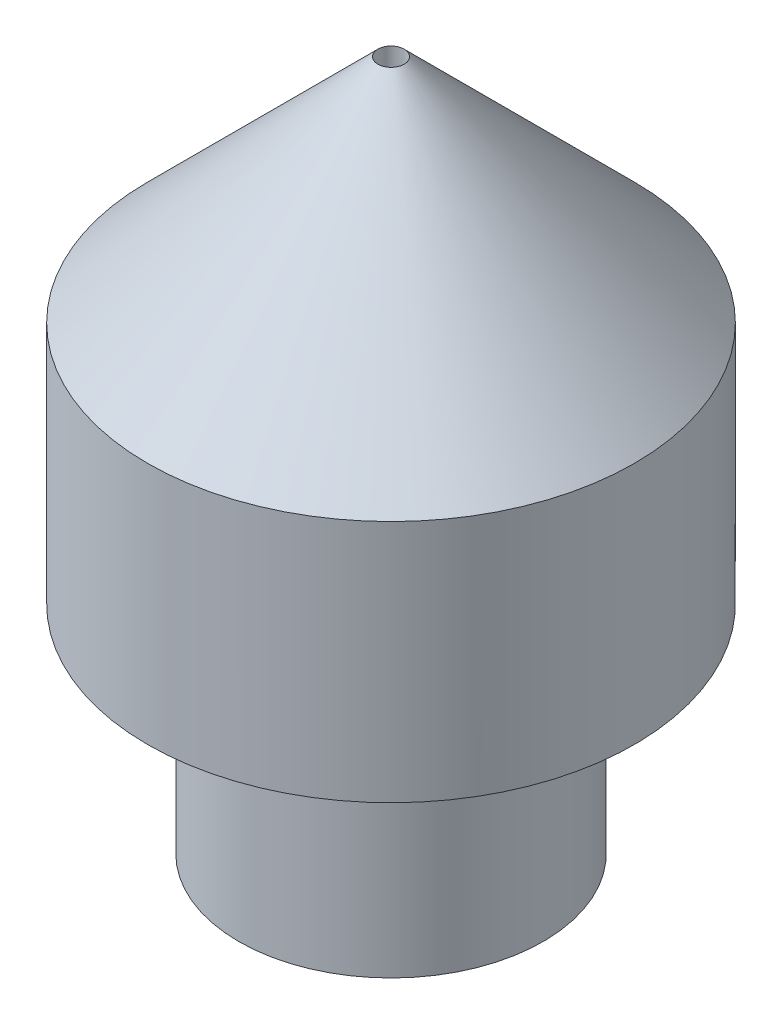
ISO-10303-21;
HEADER;
FILE_DESCRIPTION(('STEP AP214'),'2;1');
FILE_NAME('part.step','',(''),(''),'','','');
FILE_SCHEMA(('AUTOMOTIVE_DESIGN { 1 0 10303 214 1 1 1 1 }'));
ENDSEC;
DATA;
#1=APPLICATION_CONTEXT('core data for automotive mechanical design processes');
#2=APPLICATION_PROTOCOL_DEFINITION('international standard','automotive_design',2000,#1);
#3=PRODUCT_CONTEXT('',#1,'mechanical');
#4=PRODUCT('Part','Part','',(#3));
#5=PRODUCT_RELATED_PRODUCT_CATEGORY('part','',(#4));
#6=PRODUCT_DEFINITION_FORMATION('','',#4);
#7=PRODUCT_DEFINITION_CONTEXT('part definition',#1,'design');
#8=PRODUCT_DEFINITION('design','',#6,#7);
#9=PRODUCT_DEFINITION_SHAPE('','',#8);
#10=(LENGTH_UNIT() NAMED_UNIT(*) SI_UNIT(.MILLI.,.METRE.));
#11=(NAMED_UNIT(*) PLANE_ANGLE_UNIT() SI_UNIT($,.RADIAN.));
#12=(NAMED_UNIT(*) SI_UNIT($,.STERADIAN.) SOLID_ANGLE_UNIT());
#13=UNCERTAINTY_MEASURE_WITH_UNIT(LENGTH_MEASURE(1.E-05),#10,'distance_accuracy_value','');
#14=(GEOMETRIC_REPRESENTATION_CONTEXT(3) GLOBAL_UNCERTAINTY_ASSIGNED_CONTEXT((#13)) GLOBAL_UNIT_ASSIGNED_CONTEXT((#10,
#11,#12)) REPRESENTATION_CONTEXT('',''));
#15=CARTESIAN_POINT('',(0.,0.,0.));
#16=DIRECTION('',(0.,0.,1.));
#17=DIRECTION('',(1.,0.,0.));
#18=AXIS2_PLACEMENT_3D('',#15,#16,#17);
#19=CARTESIAN_POINT('',(0.,11.9722222222222,0.));
#20=DIRECTION('',(0.,1.,0.));
#21=DIRECTION('',(0.,0.,1.));
#22=AXIS2_PLACEMENT_3D('',#19,#20,#21);
#23=CYLINDRICAL_SURFACE('',#22,2.5);
#24=CARTESIAN_POINT('',(0.,-3.55376050261002,0.));
#25=DIRECTION('',(0.,1.,0.));
#26=DIRECTION('',(0.,0.,1.));
#27=AXIS2_PLACEMENT_3D('',#24,#25,#26);
#28=CIRCLE('',#27,2.5);
#29=CARTESIAN_POINT('',(0.,-3.55376050261002,2.5));
#30=VERTEX_POINT('',#29);
#31=EDGE_CURVE('E10',#30,#30,#28,.T.);
#32=ORIENTED_EDGE('',*,*,#31,.T.);
#33=EDGE_LOOP('',(#32));
#34=FACE_BOUND('',#33,.T.);
#35=CARTESIAN_POINT('',(0.,0.,0.));
#36=DIRECTION('',(0.,1.,0.));
#37=DIRECTION('',(0.,0.,1.));
#38=AXIS2_PLACEMENT_3D('',#35,#36,#37);
#39=CIRCLE('',#38,2.5);
#40=CARTESIAN_POINT('',(0.,0.,2.5));
#41=VERTEX_POINT('',#40);
#42=EDGE_CURVE('E58',#41,#41,#39,.T.);
#43=ORIENTED_EDGE('',*,*,#42,.F.);
#44=EDGE_LOOP('',(#43));
#45=FACE_BOUND('',#44,.T.);
#46=ADVANCED_FACE('F36',(#34,#45),#23,.T.);
#47=CARTESIAN_POINT('',(0.,-3.55376050261002,0.));
#48=DIRECTION('',(0.,-1.,0.));
#49=DIRECTION('',(0.,0.,-1.));
#50=AXIS2_PLACEMENT_3D('',#47,#48,#49);
#51=PLANE('',#50);
#52=CARTESIAN_POINT('',(0.,-3.55376050261002,0.));
#53=DIRECTION('',(0.,1.,0.));
#54=DIRECTION('',(0.,0.,1.));
#55=AXIS2_PLACEMENT_3D('',#52,#53,#54);
#56=CIRCLE('',#55,0.215274487423756);
#57=CARTESIAN_POINT('',(0.,-3.55376050261002,0.215274487423756));
#58=VERTEX_POINT('',#57);
#59=EDGE_CURVE('E42',#58,#58,#56,.T.);
#60=ORIENTED_EDGE('',*,*,#59,.T.);
#61=EDGE_LOOP('',(#60));
#62=FACE_BOUND('',#61,.T.);
#63=ORIENTED_EDGE('',*,*,#31,.F.);
#64=EDGE_LOOP('',(#63));
#65=FACE_BOUND('',#64,.T.);
#66=ADVANCED_FACE('F133',(#62,#65),#51,.T.);
#67=CARTESIAN_POINT('',(0.,11.9722222222222,0.));
#68=DIRECTION('',(0.,1.,0.));
#69=DIRECTION('',(0.,0.,1.));
#70=AXIS2_PLACEMENT_3D('',#67,#68,#69);
#71=CYLINDRICAL_SURFACE('',#70,0.215274487423757);
#72=CARTESIAN_POINT('',(0.,7.78472551257624,0.));
#73=DIRECTION('',(0.,1.,0.));
#74=DIRECTION('',(0.,0.,1.));
#75=AXIS2_PLACEMENT_3D('',#72,#73,#74);
#76=CIRCLE('',#75,0.215274487423759);
#77=CARTESIAN_POINT('',(0.,7.78472551257624,-0.215274487423759));
#78=VERTEX_POINT('',#77);
#79=EDGE_CURVE('E46',#78,#78,#76,.T.);
#80=ORIENTED_EDGE('',*,*,#79,.T.);
#81=EDGE_LOOP('',(#80));
#82=FACE_BOUND('',#81,.T.);
#83=ORIENTED_EDGE('',*,*,#59,.F.);
#84=EDGE_LOOP('',(#83));
#85=FACE_BOUND('',#84,.T.);
#86=ADVANCED_FACE('F130',(#82,#85),#71,.F.);
#87=CARTESIAN_POINT('',(0.,7.78472551257624,0.));
#88=DIRECTION('',(0.,-1.,0.));
#89=DIRECTION('',(0.,0.,-1.));
#90=AXIS2_PLACEMENT_3D('',#87,#88,#89);
#91=CONICAL_SURFACE('',#90,0.215274487423759,0.785398163397449);
#92=CARTESIAN_POINT('',(0.,4.,0.));
#93=DIRECTION('',(0.,1.,0.));
#94=DIRECTION('',(0.,0.,1.));
#95=AXIS2_PLACEMENT_3D('',#92,#93,#94);
#96=CIRCLE('',#95,4.);
#97=CARTESIAN_POINT('',(0.,4.,-4.));
#98=VERTEX_POINT('',#97);
#99=EDGE_CURVE('E50',#98,#98,#96,.T.);
#100=CARTESIAN_POINT('',(0.,4.,-4.));
#101=CARTESIAN_POINT('',(0.,4.03942422408933,-3.96057577591067));
#102=CARTESIAN_POINT('',(0.,4.07884844817867,-3.92115155182133));
#103=CARTESIAN_POINT('',(0.,4.15769689635734,-3.84230310364266));
#104=CARTESIAN_POINT('',(0.,4.19712112044668,-3.80287887955332));
#105=CARTESIAN_POINT('',(0.,4.27596956862535,-3.72403043137465));
#106=CARTESIAN_POINT('',(0.,4.31539379271469,-3.68460620728531));
#107=CARTESIAN_POINT('',(0.,4.39424224089336,-3.60575775910664));
#108=CARTESIAN_POINT('',(0.,4.43366646498269,-3.56633353501731));
#109=CARTESIAN_POINT('',(0.,4.51251491316136,-3.48748508683863));
#110=CARTESIAN_POINT('',(0.,4.5519391372507,-3.4480608627493));
#111=CARTESIAN_POINT('',(0.,4.63078758542937,-3.36921241457063));
#112=CARTESIAN_POINT('',(0.,4.67021180951871,-3.32978819048129));
#113=CARTESIAN_POINT('',(0.,4.74906025769738,-3.25093974230262));
#114=CARTESIAN_POINT('',(0.,4.78848448178671,-3.21151551821328));
#115=CARTESIAN_POINT('',(0.,4.86733292996539,-3.13266707003461));
#116=CARTESIAN_POINT('',(0.,4.90675715405472,-3.09324284594528));
#117=CARTESIAN_POINT('',(0.,4.98560560223339,-3.0143943977666));
#118=CARTESIAN_POINT('',(0.,5.02502982632273,-2.97497017367727));
#119=CARTESIAN_POINT('',(0.,5.1038782745014,-2.8961217254986));
#120=CARTESIAN_POINT('',(0.,5.14330249859074,-2.85669750140926));
#121=CARTESIAN_POINT('',(0.,5.22215094676941,-2.77784905323059));
#122=CARTESIAN_POINT('',(0.,5.26157517085874,-2.73842482914125));
#123=CARTESIAN_POINT('',(0.,5.34042361903742,-2.65957638096258));
#124=CARTESIAN_POINT('',(0.,5.37984784312675,-2.62015215687325));
#125=CARTESIAN_POINT('',(0.,5.45869629130542,-2.54130370869457));
#126=CARTESIAN_POINT('',(0.,5.49812051539476,-2.50187948460524));
#127=CARTESIAN_POINT('',(0.,5.57696896357343,-2.42303103642657));
#128=CARTESIAN_POINT('',(0.,5.61639318766277,-2.38360681233723));
#129=CARTESIAN_POINT('',(0.,5.69524163584144,-2.30475836415856));
#130=CARTESIAN_POINT('',(0.,5.73466585993077,-2.26533414006922));
#131=CARTESIAN_POINT('',(0.,5.81351430810945,-2.18648569189055));
#132=CARTESIAN_POINT('',(0.,5.85293853219878,-2.14706146780122));
#133=CARTESIAN_POINT('',(0.,5.93178698037745,-2.06821301962254));
#134=CARTESIAN_POINT('',(0.,5.97121120446679,-2.02878879553321));
#135=CARTESIAN_POINT('',(0.,6.05005965264546,-1.94994034735454));
#136=CARTESIAN_POINT('',(0.,6.0894838767348,-1.9105161232652));
#137=CARTESIAN_POINT('',(0.,6.16833232491347,-1.83166767508653));
#138=CARTESIAN_POINT('',(0.,6.2077565490028,-1.79224345099719));
#139=CARTESIAN_POINT('',(0.,6.28660499718147,-1.71339500281852));
#140=CARTESIAN_POINT('',(0.,6.32602922127081,-1.67397077872919));
#141=CARTESIAN_POINT('',(0.,6.40487766944948,-1.59512233055051));
#142=CARTESIAN_POINT('',(0.,6.44430189353882,-1.55569810646118));
#143=CARTESIAN_POINT('',(0.,6.52315034171749,-1.47684965828251));
#144=CARTESIAN_POINT('',(0.,6.56257456580683,-1.43742543419317));
#145=CARTESIAN_POINT('',(0.,6.6414230139855,-1.3585769860145));
#146=CARTESIAN_POINT('',(0.,6.68084723807483,-1.31915276192516));
#147=CARTESIAN_POINT('',(0.,6.75969568625351,-1.24030431374649));
#148=CARTESIAN_POINT('',(0.,6.79911991034284,-1.20088008965716));
#149=CARTESIAN_POINT('',(0.,6.87796835852151,-1.12203164147848));
#150=CARTESIAN_POINT('',(0.,6.91739258261085,-1.08260741738915));
#151=CARTESIAN_POINT('',(0.,6.99624103078952,-1.00375896921048));
#152=CARTESIAN_POINT('',(0.,7.03566525487885,-0.96433474512114));
#153=CARTESIAN_POINT('',(0.,7.11451370305753,-0.885486296942469));
#154=CARTESIAN_POINT('',(0.,7.15393792714686,-0.846062072853133));
#155=CARTESIAN_POINT('',(0.,7.23278637532553,-0.767213624674461));
#156=CARTESIAN_POINT('',(0.,7.27221059941487,-0.727789400585125));
#157=CARTESIAN_POINT('',(0.,7.35105904759354,-0.648940952406454));
#158=CARTESIAN_POINT('',(0.,7.39048327168288,-0.609516728317118));
#159=CARTESIAN_POINT('',(0.,7.46933171986155,-0.530668280138446));
#160=CARTESIAN_POINT('',(0.,7.50875594395089,-0.49124405604911));
#161=CARTESIAN_POINT('',(0.,7.58760439212956,-0.412395607870438));
#162=CARTESIAN_POINT('',(0.,7.62702861621889,-0.372971383781102));
#163=CARTESIAN_POINT('',(0.,7.70587706439756,-0.294122935602431));
#164=CARTESIAN_POINT('',(0.,7.7453012884869,-0.254698711513095));
#165=CARTESIAN_POINT('',(0.,7.78472551257624,-0.215274487423759));
#166=B_SPLINE_CURVE_WITH_KNOTS('',3,(#100,#101,#102,#103,#104,#105,#106,#107,#108,#109,#110,
#111,#112,#113,#114,#115,#116,#117,#118,#119,#120,#121,#122,#123,#124,#125,#126,#127,#128,#129,
#130,#131,#132,#133,#134,#135,#136,#137,#138,#139,#140,#141,#142,#143,#144,#145,#146,#147,#148,
#149,#150,#151,#152,#153,#154,#155,#156,#157,#158,#159,#160,#161,#162,#163,#164,#165),
.UNSPECIFIED.,.F.,.F.,(4,2,2,2,2,2,2,2,2,2,2,2,2,2,2,2,2,2,2,2,2,2,2,2,2,2,2,2,2,2,2,2,4),(0.,
0.167262817179524,0.334525634359049,0.501788451538574,0.669051268718099,0.836314085897623,
1.00357690307715,1.17083972025667,1.3381025374362,1.50536535461572,1.67262817179524,
1.83989098897477,2.00715380615429,2.17441662333382,2.34167944051334,2.50894225769287,
2.67620507487239,2.84346789205192,3.01073070923144,3.17799352641096,3.34525634359049,
3.51251916077001,3.67978197794954,3.84704479512906,4.01430761230859,4.18157042948811,
4.34883324666764,4.51609606384716,4.68335888102669,4.85062169820621,5.01788451538573,
5.18514733256526,5.35241014974478),.UNSPECIFIED.);
#167=EDGE_CURVE('BSEAM126',#98,#78,#166,.T.);
#168=ORIENTED_EDGE('',*,*,#99,.T.);
#169=ORIENTED_EDGE('',*,*,#79,.F.);
#170=ORIENTED_EDGE('',*,*,#167,.T.);
#171=ORIENTED_EDGE('',*,*,#167,.F.);
#172=EDGE_LOOP('',(#168,#170,#169,#171));
#173=FACE_BOUND('',#172,.T.);
#174=ADVANCED_FACE('F126',(#173),#91,.T.);
#175=CARTESIAN_POINT('',(0.,11.9722222222222,0.));
#176=DIRECTION('',(0.,1.,0.));
#177=DIRECTION('',(0.,0.,1.));
#178=AXIS2_PLACEMENT_3D('',#175,#176,#177);
#179=CYLINDRICAL_SURFACE('',#178,4.);
#180=CARTESIAN_POINT('',(0.,0.,0.));
#181=DIRECTION('',(0.,1.,0.));
#182=DIRECTION('',(0.,0.,1.));
#183=AXIS2_PLACEMENT_3D('',#180,#181,#182);
#184=CIRCLE('',#183,4.);
#185=CARTESIAN_POINT('',(0.,0.,4.));
#186=VERTEX_POINT('',#185);
#187=EDGE_CURVE('E55',#186,#186,#184,.T.);
#188=ORIENTED_EDGE('',*,*,#187,.T.);
#189=EDGE_LOOP('',(#188));
#190=FACE_BOUND('',#189,.T.);
#191=ORIENTED_EDGE('',*,*,#99,.F.);
#192=EDGE_LOOP('',(#191));
#193=FACE_BOUND('',#192,.T.);
#194=ADVANCED_FACE('F122',(#190,#193),#179,.T.);
#195=CARTESIAN_POINT('',(0.,0.,0.));
#196=DIRECTION('',(0.,-1.,0.));
#197=DIRECTION('',(0.,0.,-1.));
#198=AXIS2_PLACEMENT_3D('',#195,#196,#197);
#199=PLANE('',#198);
#200=ORIENTED_EDGE('',*,*,#42,.T.);
#201=EDGE_LOOP('',(#200));
#202=FACE_BOUND('',#201,.T.);
#203=ORIENTED_EDGE('',*,*,#187,.F.);
#204=EDGE_LOOP('',(#203));
#205=FACE_BOUND('',#204,.T.);
#206=ADVANCED_FACE('F120',(#202,#205),#199,.T.);
#207=CLOSED_SHELL('',(#46,#66,#86,#174,#194,#206));
#208=CARTESIAN_POINT('',(0.,11.9722222222222,0.));
#209=DIRECTION('',(0.,1.,0.));
#210=DIRECTION('',(0.,0.,1.));
#211=AXIS2_PLACEMENT_3D('',#208,#209,#210);
#212=CYLINDRICAL_SURFACE('',#211,2.3);
#213=CARTESIAN_POINT('',(0.,-3.35376050261002,0.));
#214=DIRECTION('',(0.,1.,0.));
#215=DIRECTION('',(0.,0.,1.));
#216=AXIS2_PLACEMENT_3D('',#213,#214,#215);
#217=CIRCLE('',#216,2.3);
#218=CARTESIAN_POINT('',(0.,-3.35376050261002,2.3));
#219=VERTEX_POINT('',#218);
#220=EDGE_CURVE('E61',#219,#219,#217,.T.);
#221=ORIENTED_EDGE('',*,*,#220,.F.);
#222=EDGE_LOOP('',(#221));
#223=FACE_BOUND('',#222,.T.);
#224=CARTESIAN_POINT('',(0.,0.200000000000001,0.));
#225=DIRECTION('',(0.,1.,0.));
#226=DIRECTION('',(0.,0.,1.));
#227=AXIS2_PLACEMENT_3D('',#224,#225,#226);
#228=CIRCLE('',#227,2.3);
#229=CARTESIAN_POINT('',(0.,0.200000000000001,2.3));
#230=VERTEX_POINT('',#229);
#231=EDGE_CURVE('E76',#230,#230,#228,.T.);
#232=ORIENTED_EDGE('',*,*,#231,.T.);
#233=EDGE_LOOP('',(#232));
#234=FACE_BOUND('',#233,.T.);
#235=ADVANCED_FACE('F80',(#223,#234),#212,.F.);
#236=CARTESIAN_POINT('',(0.,-3.35376050261002,0.));
#237=DIRECTION('',(0.,-1.,0.));
#238=DIRECTION('',(0.,0.,-1.));
#239=AXIS2_PLACEMENT_3D('',#236,#237,#238);
#240=PLANE('',#239);
#241=CARTESIAN_POINT('',(0.,-3.35376050261002,0.));
#242=DIRECTION('',(0.,1.,0.));
#243=DIRECTION('',(0.,0.,1.));
#244=AXIS2_PLACEMENT_3D('',#241,#242,#243);
#245=CIRCLE('',#244,0.415274487423756);
#246=CARTESIAN_POINT('',(0.,-3.35376050261002,0.415274487423756));
#247=VERTEX_POINT('',#246);
#248=EDGE_CURVE('E64',#247,#247,#245,.T.);
#249=ORIENTED_EDGE('',*,*,#248,.F.);
#250=EDGE_LOOP('',(#249));
#251=FACE_BOUND('',#250,.T.);
#252=ORIENTED_EDGE('',*,*,#220,.T.);
#253=EDGE_LOOP('',(#252));
#254=FACE_BOUND('',#253,.T.);
#255=ADVANCED_FACE('F104',(#251,#254),#240,.F.);
#256=CARTESIAN_POINT('',(0.,11.9722222222222,0.));
#257=DIRECTION('',(0.,1.,0.));
#258=DIRECTION('',(0.,0.,1.));
#259=AXIS2_PLACEMENT_3D('',#256,#257,#258);
#260=CYLINDRICAL_SURFACE('',#259,0.415274487423757);
#261=CARTESIAN_POINT('',(0.,7.30188280010162,0.));
#262=DIRECTION('',(0.,1.,0.));
#263=DIRECTION('',(0.,0.,1.));
#264=AXIS2_PLACEMENT_3D('',#261,#262,#263);
#265=CIRCLE('',#264,0.415274487423759);
#266=CARTESIAN_POINT('',(0.,7.30188280010162,-0.415274487423759));
#267=VERTEX_POINT('',#266);
#268=EDGE_CURVE('E67',#267,#267,#265,.T.);
#269=ORIENTED_EDGE('',*,*,#268,.F.);
#270=EDGE_LOOP('',(#269));
#271=FACE_BOUND('',#270,.T.);
#272=ORIENTED_EDGE('',*,*,#248,.T.);
#273=EDGE_LOOP('',(#272));
#274=FACE_BOUND('',#273,.T.);
#275=ADVANCED_FACE('F98',(#271,#274),#260,.T.);
#276=CARTESIAN_POINT('',(0.,7.30188280010162,0.));
#277=DIRECTION('',(0.,-1.,0.));
#278=DIRECTION('',(0.,0.,-1.));
#279=AXIS2_PLACEMENT_3D('',#276,#277,#278);
#280=CONICAL_SURFACE('',#279,0.415274487423759,0.785398163397449);
#281=CARTESIAN_POINT('',(0.,3.91715728752538,0.));
#282=DIRECTION('',(0.,1.,0.));
#283=DIRECTION('',(0.,0.,1.));
#284=AXIS2_PLACEMENT_3D('',#281,#282,#283);
#285=CIRCLE('',#284,3.8);
#286=CARTESIAN_POINT('',(0.,3.91715728752538,-3.8));
#287=VERTEX_POINT('',#286);
#288=EDGE_CURVE('E70',#287,#287,#285,.T.);
#289=CARTESIAN_POINT('',(0.,3.91715728752538,-3.8));
#290=CARTESIAN_POINT('',(0.,3.95241484494805,-3.76474244257733));
#291=CARTESIAN_POINT('',(0.,3.98767240237072,-3.72948488515466));
#292=CARTESIAN_POINT('',(0.,4.05818751721606,-3.65896977030932));
#293=CARTESIAN_POINT('',(0.,4.09344507463872,-3.62371221288665));
#294=CARTESIAN_POINT('',(0.,4.16396018948406,-3.55319709804132));
#295=CARTESIAN_POINT('',(0.,4.19921774690673,-3.51793954061865));
#296=CARTESIAN_POINT('',(0.,4.26973286175207,-3.44742442577331));
#297=CARTESIAN_POINT('',(0.,4.30499041917474,-3.41216686835064));
#298=CARTESIAN_POINT('',(0.,4.37550553402008,-3.3416517535053));
#299=CARTESIAN_POINT('',(0.,4.41076309144275,-3.30639419608263));
#300=CARTESIAN_POINT('',(0.,4.48127820628808,-3.23587908123729));
#301=CARTESIAN_POINT('',(0.,4.51653576371075,-3.20062152381462));
#302=CARTESIAN_POINT('',(0.,4.58705087855609,-3.13010640896929));
#303=CARTESIAN_POINT('',(0.,4.62230843597876,-3.09484885154662));
#304=CARTESIAN_POINT('',(0.,4.6928235508241,-3.02433373670128));
#305=CARTESIAN_POINT('',(0.,4.72808110824677,-2.98907617927861));
#306=CARTESIAN_POINT('',(0.,4.79859622309211,-2.91856106443327));
#307=CARTESIAN_POINT('',(0.,4.83385378051478,-2.8833035070106));
#308=CARTESIAN_POINT('',(0.,4.90436889536011,-2.81278839216526));
#309=CARTESIAN_POINT('',(0.,4.93962645278278,-2.77753083474259));
#310=CARTESIAN_POINT('',(0.,5.01014156762812,-2.70701571989726));
#311=CARTESIAN_POINT('',(0.,5.04539912505079,-2.67175816247459));
#312=CARTESIAN_POINT('',(0.,5.11591423989613,-2.60124304762925));
#313=CARTESIAN_POINT('',(0.,5.1511717973188,-2.56598549020658));
#314=CARTESIAN_POINT('',(0.,5.22168691216414,-2.49547037536124));
#315=CARTESIAN_POINT('',(0.,5.25694446958681,-2.46021281793857));
#316=CARTESIAN_POINT('',(0.,5.32745958443214,-2.38969770309323));
#317=CARTESIAN_POINT('',(0.,5.36271714185481,-2.35444014567056));
#318=CARTESIAN_POINT('',(0.,5.43323225670015,-2.28392503082523));
#319=CARTESIAN_POINT('',(0.,5.46848981412282,-2.24866747340256));
#320=CARTESIAN_POINT('',(0.,5.53900492896816,-2.17815235855722));
#321=CARTESIAN_POINT('',(0.,5.57426248639083,-2.14289480113455));
#322=CARTESIAN_POINT('',(0.,5.64477760123617,-2.07237968628921));
#323=CARTESIAN_POINT('',(0.,5.68003515865884,-2.03712212886654));
#324=CARTESIAN_POINT('',(0.,5.75055027350417,-1.9666070140212));
#325=CARTESIAN_POINT('',(0.,5.78580783092684,-1.93134945659853));
#326=CARTESIAN_POINT('',(0.,5.85632294577218,-1.8608343417532));
#327=CARTESIAN_POINT('',(0.,5.89158050319485,-1.82557678433053));
#328=CARTESIAN_POINT('',(0.,5.96209561804019,-1.75506166948519));
#329=CARTESIAN_POINT('',(0.,5.99735317546286,-1.71980411206252));
#330=CARTESIAN_POINT('',(0.,6.0678682903082,-1.64928899721718));
#331=CARTESIAN_POINT('',(0.,6.10312584773087,-1.61403143979451));
#332=CARTESIAN_POINT('',(0.,6.1736409625762,-1.54351632494917));
#333=CARTESIAN_POINT('',(0.,6.20889851999887,-1.5082587675265));
#334=CARTESIAN_POINT('',(0.,6.27941363484421,-1.43774365268117));
#335=CARTESIAN_POINT('',(0.,6.31467119226688,-1.4024860952585));
#336=CARTESIAN_POINT('',(0.,6.38518630711222,-1.33197098041316));
#337=CARTESIAN_POINT('',(0.,6.42044386453489,-1.29671342299049));
#338=CARTESIAN_POINT('',(0.,6.49095897938023,-1.22619830814515));
#339=CARTESIAN_POINT('',(0.,6.5262165368029,-1.19094075072248));
#340=CARTESIAN_POINT('',(0.,6.59673165164823,-1.12042563587714));
#341=CARTESIAN_POINT('',(0.,6.6319892090709,-1.08516807845447));
#342=CARTESIAN_POINT('',(0.,6.70250432391624,-1.01465296360914));
#343=CARTESIAN_POINT('',(0.,6.73776188133891,-0.979395406186466));
#344=CARTESIAN_POINT('',(0.,6.80827699618425,-0.908880291341127));
#345=CARTESIAN_POINT('',(0.,6.84353455360692,-0.873622733918458));
#346=CARTESIAN_POINT('',(0.,6.91404966845226,-0.80310761907312));
#347=CARTESIAN_POINT('',(0.,6.94930722587493,-0.767850061650451));
#348=CARTESIAN_POINT('',(0.,7.01982234072026,-0.697334946805112));
#349=CARTESIAN_POINT('',(0.,7.05507989814293,-0.662077389382443));
#350=CARTESIAN_POINT('',(0.,7.12559501298827,-0.591562274537105));
#351=CARTESIAN_POINT('',(0.,7.16085257041094,-0.556304717114436));
#352=CARTESIAN_POINT('',(0.,7.23136768525628,-0.485789602269097));
#353=CARTESIAN_POINT('',(0.,7.26662524267895,-0.450532044846428));
#354=CARTESIAN_POINT('',(0.,7.30188280010162,-0.415274487423759));
#355=B_SPLINE_CURVE_WITH_KNOTS('',3,(#289,#290,#291,#292,#293,#294,#295,#296,#297,#298,#299,
#300,#301,#302,#303,#304,#305,#306,#307,#308,#309,#310,#311,#312,#313,#314,#315,#316,#317,#318,
#319,#320,#321,#322,#323,#324,#325,#326,#327,#328,#329,#330,#331,#332,#333,#334,#335,#336,#337,
#338,#339,#340,#341,#342,#343,#344,#345,#346,#347,#348,#349,#350,#351,#352,#353,#354),
.UNSPECIFIED.,.F.,.F.,(4,2,2,2,2,2,2,2,2,2,2,2,2,2,2,2,2,2,2,2,2,2,2,2,2,2,2,2,2,2,2,2,4),(0.,
0.149585147649861,0.299170295299722,0.448755442949582,0.598340590599443,0.747925738249304,
0.897510885899164,1.04709603354903,1.19668118119889,1.34626632884875,1.49585147649861,
1.64543662414847,1.79502177179833,1.94460691944819,2.09419206709805,2.24377721474791,
2.39336236239777,2.54294751004763,2.69253265769749,2.84211780534735,2.99170295299721,
3.14128810064708,3.29087324829694,3.4404583959468,3.59004354359666,3.73962869124652,
3.88921383889638,4.03879898654624,4.1883841341961,4.33796928184596,4.48755442949582,
4.63713957714568,4.78672472479554),.UNSPECIFIED.);
#356=EDGE_CURVE('BSEAM92',#287,#267,#355,.T.);
#357=ORIENTED_EDGE('',*,*,#288,.F.);
#358=ORIENTED_EDGE('',*,*,#268,.T.);
#359=ORIENTED_EDGE('',*,*,#356,.T.);
#360=ORIENTED_EDGE('',*,*,#356,.F.);
#361=EDGE_LOOP('',(#357,#359,#358,#360));
#362=FACE_BOUND('',#361,.T.);
#363=ADVANCED_FACE('F92',(#362),#280,.F.);
#364=CARTESIAN_POINT('',(0.,11.9722222222222,0.));
#365=DIRECTION('',(0.,1.,0.));
#366=DIRECTION('',(0.,0.,1.));
#367=AXIS2_PLACEMENT_3D('',#364,#365,#366);
#368=CYLINDRICAL_SURFACE('',#367,3.8);
#369=CARTESIAN_POINT('',(0.,0.200000000000001,0.));
#370=DIRECTION('',(0.,1.,0.));
#371=DIRECTION('',(0.,0.,1.));
#372=AXIS2_PLACEMENT_3D('',#369,#370,#371);
#373=CIRCLE('',#372,3.8);
#374=CARTESIAN_POINT('',(0.,0.200000000000001,3.8));
#375=VERTEX_POINT('',#374);
#376=EDGE_CURVE('E73',#375,#375,#373,.T.);
#377=ORIENTED_EDGE('',*,*,#376,.F.);
#378=EDGE_LOOP('',(#377));
#379=FACE_BOUND('',#378,.T.);
#380=ORIENTED_EDGE('',*,*,#288,.T.);
#381=EDGE_LOOP('',(#380));
#382=FACE_BOUND('',#381,.T.);
#383=ADVANCED_FACE('F85',(#379,#382),#368,.F.);
#384=CARTESIAN_POINT('',(0.,0.2,0.));
#385=DIRECTION('',(0.,-1.,0.));
#386=DIRECTION('',(0.,0.,-1.));
#387=AXIS2_PLACEMENT_3D('',#384,#385,#386);
#388=PLANE('',#387);
#389=ORIENTED_EDGE('',*,*,#231,.F.);
#390=EDGE_LOOP('',(#389));
#391=FACE_BOUND('',#390,.T.);
#392=ORIENTED_EDGE('',*,*,#376,.T.);
#393=EDGE_LOOP('',(#392));
#394=FACE_BOUND('',#393,.T.);
#395=ADVANCED_FACE('F82',(#391,#394),#388,.F.);
#396=CLOSED_SHELL('',(#235,#255,#275,#363,#383,#395));
#397=ORIENTED_CLOSED_SHELL('',*,#396,.T.);
#398=BREP_WITH_VOIDS('B2',#207,(#397));
#399=ADVANCED_BREP_SHAPE_REPRESENTATION('',(#18,#398),#14);
#400=SHAPE_DEFINITION_REPRESENTATION(#9,#399);
ENDSEC;
END-ISO-10303-21;
